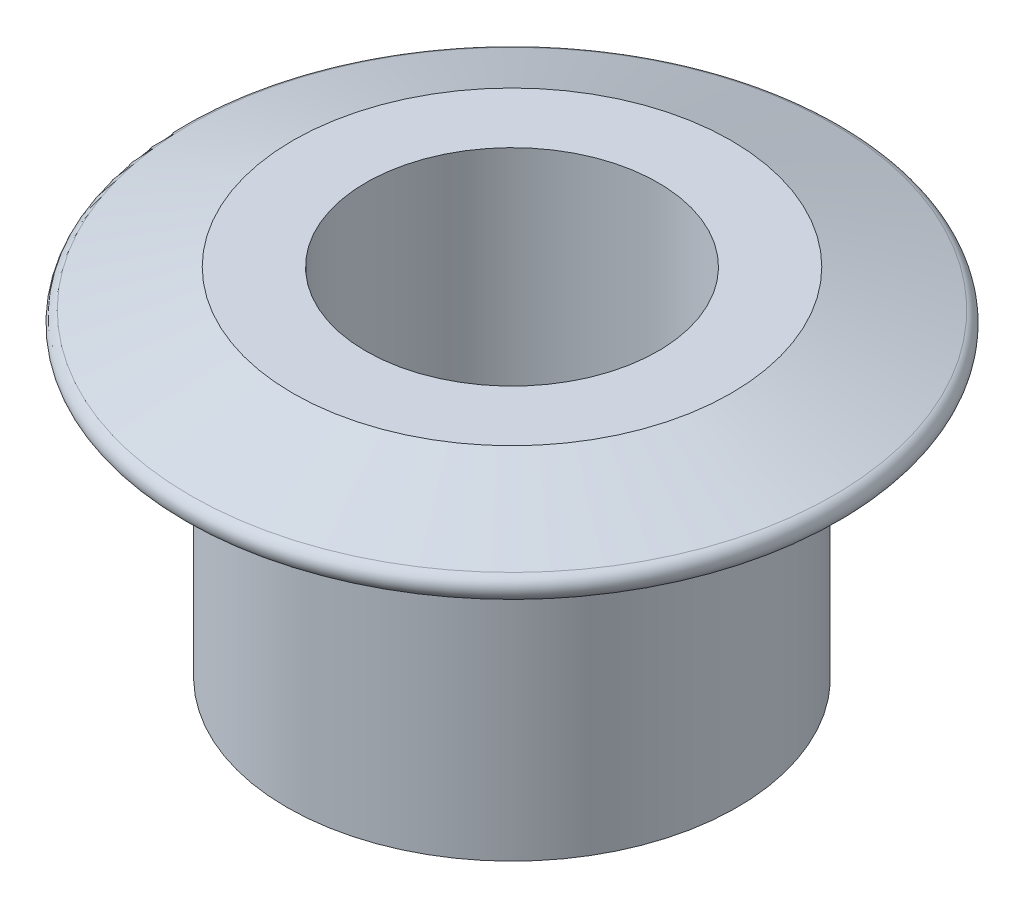
ISO-10303-21;
HEADER;
FILE_DESCRIPTION(('STEP AP214'),'2;1');
FILE_NAME('part.step','',(''),(''),'','','');
FILE_SCHEMA(('AUTOMOTIVE_DESIGN { 1 0 10303 214 1 1 1 1 }'));
ENDSEC;
DATA;
#1=APPLICATION_CONTEXT('core data for automotive mechanical design processes');
#2=APPLICATION_PROTOCOL_DEFINITION('international standard','automotive_design',2000,#1);
#3=PRODUCT_CONTEXT('',#1,'mechanical');
#4=PRODUCT('Part','Part','',(#3));
#5=PRODUCT_RELATED_PRODUCT_CATEGORY('part','',(#4));
#6=PRODUCT_DEFINITION_FORMATION('','',#4);
#7=PRODUCT_DEFINITION_CONTEXT('part definition',#1,'design');
#8=PRODUCT_DEFINITION('design','',#6,#7);
#9=PRODUCT_DEFINITION_SHAPE('','',#8);
#10=(LENGTH_UNIT() NAMED_UNIT(*) SI_UNIT(.MILLI.,.METRE.));
#11=(NAMED_UNIT(*) PLANE_ANGLE_UNIT() SI_UNIT($,.RADIAN.));
#12=(NAMED_UNIT(*) SI_UNIT($,.STERADIAN.) SOLID_ANGLE_UNIT());
#13=UNCERTAINTY_MEASURE_WITH_UNIT(LENGTH_MEASURE(1.E-05),#10,'distance_accuracy_value','');
#14=(GEOMETRIC_REPRESENTATION_CONTEXT(3) GLOBAL_UNCERTAINTY_ASSIGNED_CONTEXT((#13)) GLOBAL_UNIT_ASSIGNED_CONTEXT((#10,
#11,#12)) REPRESENTATION_CONTEXT('',''));
#15=CARTESIAN_POINT('',(0.,0.,0.));
#16=DIRECTION('',(0.,0.,1.));
#17=DIRECTION('',(1.,0.,0.));
#18=AXIS2_PLACEMENT_3D('',#15,#16,#17);
#19=CARTESIAN_POINT('',(0.,5.,0.));
#20=DIRECTION('',(0.,-1.,0.));
#21=DIRECTION('',(0.,0.,-1.));
#22=AXIS2_PLACEMENT_3D('',#19,#20,#21);
#23=PLANE('',#22);
#24=CARTESIAN_POINT('',(0.,5.,0.));
#25=DIRECTION('',(0.,1.,0.));
#26=DIRECTION('',(0.,0.,1.));
#27=AXIS2_PLACEMENT_3D('',#24,#25,#26);
#28=CIRCLE('',#27,12.);
#29=CARTESIAN_POINT('',(0.,5.,12.));
#30=VERTEX_POINT('',#29);
#31=EDGE_CURVE('E57',#30,#30,#28,.T.);
#32=ORIENTED_EDGE('',*,*,#31,.F.);
#33=EDGE_LOOP('',(#32));
#34=FACE_BOUND('',#33,.T.);
#35=CARTESIAN_POINT('',(0.,5.,0.));
#36=DIRECTION('',(0.,1.,0.));
#37=DIRECTION('',(0.,0.,1.));
#38=AXIS2_PLACEMENT_3D('',#35,#36,#37);
#39=CIRCLE('',#38,18.);
#40=CARTESIAN_POINT('',(0.,5.,18.));
#41=VERTEX_POINT('',#40);
#42=EDGE_CURVE('E42',#41,#41,#39,.T.);
#43=ORIENTED_EDGE('',*,*,#42,.T.);
#44=EDGE_LOOP('',(#43));
#45=FACE_BOUND('',#44,.T.);
#46=ADVANCED_FACE('F31',(#34,#45),#23,.F.);
#47=CARTESIAN_POINT('',(0.,0.,0.));
#48=DIRECTION('',(0.,-1.,0.));
#49=DIRECTION('',(0.,0.,-1.));
#50=AXIS2_PLACEMENT_3D('',#47,#48,#49);
#51=CONICAL_SURFACE('',#50,31.76,1.22225874991077);
#52=CARTESIAN_POINT('',(0.,1.93987316983936,0.));
#53=DIRECTION('',(0.,1.,0.));
#54=DIRECTION('',(0.,0.,1.));
#55=AXIS2_PLACEMENT_3D('',#52,#53,#54);
#56=CIRCLE('',#55,26.4214690366021);
#57=CARTESIAN_POINT('',(0.,1.93987316983936,26.4214690366021));
#58=VERTEX_POINT('',#57);
#59=EDGE_CURVE('E38',#58,#58,#56,.T.);
#60=ORIENTED_EDGE('',*,*,#59,.T.);
#61=EDGE_LOOP('',(#60));
#62=FACE_BOUND('',#61,.T.);
#63=ORIENTED_EDGE('',*,*,#42,.F.);
#64=EDGE_LOOP('',(#63));
#65=FACE_BOUND('',#64,.T.);
#66=ADVANCED_FACE('F66',(#62,#65),#51,.T.);
#67=CARTESIAN_POINT('',(31.76,0.,0.));
#68=DIRECTION('',(0.,1.,0.));
#69=DIRECTION('',(0.,0.,1.));
#70=AXIS2_PLACEMENT_3D('',#67,#68,#69);
#71=PLANE('',#70);
#72=CARTESIAN_POINT('',(0.,0.,0.));
#73=DIRECTION('',(0.,1.,0.));
#74=DIRECTION('',(0.,0.,1.));
#75=AXIS2_PLACEMENT_3D('',#72,#73,#74);
#76=CIRCLE('',#75,26.0799453557012);
#77=CARTESIAN_POINT('',(0.,0.,26.0799453557012));
#78=VERTEX_POINT('',#77);
#79=EDGE_CURVE('E10',#78,#78,#76,.F.);
#80=ORIENTED_EDGE('',*,*,#79,.T.);
#81=EDGE_LOOP('',(#80));
#82=FACE_BOUND('',#81,.T.);
#83=CARTESIAN_POINT('',(0.,0.,0.));
#84=DIRECTION('',(0.,1.,0.));
#85=DIRECTION('',(0.,0.,1.));
#86=AXIS2_PLACEMENT_3D('',#83,#84,#85);
#87=CIRCLE('',#86,18.5);
#88=CARTESIAN_POINT('',(0.,0.,18.5));
#89=VERTEX_POINT('',#88);
#90=EDGE_CURVE('E46',#89,#89,#87,.T.);
#91=ORIENTED_EDGE('',*,*,#90,.T.);
#92=EDGE_LOOP('',(#91));
#93=FACE_BOUND('',#92,.T.);
#94=ADVANCED_FACE('F70',(#82,#93),#71,.F.);
#95=CARTESIAN_POINT('',(0.,25.0606870229008,0.));
#96=DIRECTION('',(0.,1.,0.));
#97=DIRECTION('',(0.,0.,1.));
#98=AXIS2_PLACEMENT_3D('',#95,#96,#97);
#99=CYLINDRICAL_SURFACE('',#98,18.5);
#100=ORIENTED_EDGE('',*,*,#90,.F.);
#101=EDGE_LOOP('',(#100));
#102=FACE_BOUND('',#101,.T.);
#103=CARTESIAN_POINT('',(0.,-24.21,0.));
#104=DIRECTION('',(0.,1.,0.));
#105=DIRECTION('',(0.,0.,1.));
#106=AXIS2_PLACEMENT_3D('',#103,#104,#105);
#107=CIRCLE('',#106,18.5);
#108=CARTESIAN_POINT('',(0.,-24.21,18.5));
#109=VERTEX_POINT('',#108);
#110=EDGE_CURVE('E51',#109,#109,#107,.T.);
#111=ORIENTED_EDGE('',*,*,#110,.T.);
#112=EDGE_LOOP('',(#111));
#113=FACE_BOUND('',#112,.T.);
#114=ADVANCED_FACE('F75',(#102,#113),#99,.T.);
#115=CARTESIAN_POINT('',(18.5,-24.21,0.));
#116=DIRECTION('',(0.,1.,0.));
#117=DIRECTION('',(0.,0.,1.));
#118=AXIS2_PLACEMENT_3D('',#115,#116,#117);
#119=PLANE('',#118);
#120=CARTESIAN_POINT('',(0.,-24.21,0.));
#121=DIRECTION('',(0.,1.,0.));
#122=DIRECTION('',(0.,0.,1.));
#123=AXIS2_PLACEMENT_3D('',#120,#121,#122);
#124=CIRCLE('',#123,12.);
#125=CARTESIAN_POINT('',(0.,-24.21,12.));
#126=VERTEX_POINT('',#125);
#127=EDGE_CURVE('E54',#126,#126,#124,.F.);
#128=ORIENTED_EDGE('',*,*,#127,.F.);
#129=EDGE_LOOP('',(#128));
#130=FACE_BOUND('',#129,.T.);
#131=ORIENTED_EDGE('',*,*,#110,.F.);
#132=EDGE_LOOP('',(#131));
#133=FACE_BOUND('',#132,.T.);
#134=ADVANCED_FACE('F80',(#130,#133),#119,.F.);
#135=CARTESIAN_POINT('',(0.,-24.211,0.));
#136=DIRECTION('',(0.,1.,0.));
#137=DIRECTION('',(0.,0.,1.));
#138=AXIS2_PLACEMENT_3D('',#135,#136,#137);
#139=CYLINDRICAL_SURFACE('',#138,12.);
#140=ORIENTED_EDGE('',*,*,#31,.T.);
#141=EDGE_LOOP('',(#140));
#142=FACE_BOUND('',#141,.T.);
#143=ORIENTED_EDGE('',*,*,#127,.T.);
#144=EDGE_LOOP('',(#143));
#145=FACE_BOUND('',#144,.T.);
#146=ADVANCED_FACE('F61',(#142,#145),#139,.F.);
#147=CARTESIAN_POINT('',(0.,0.999999999999999,0.));
#148=DIRECTION('',(0.,1.,0.));
#149=DIRECTION('',(0.,0.,1.));
#150=AXIS2_PLACEMENT_3D('',#147,#148,#149);
#151=TOROIDAL_SURFACE('',#150,26.0799453557012,1.);
#152=ORIENTED_EDGE('',*,*,#79,.F.);
#153=EDGE_LOOP('',(#152));
#154=FACE_BOUND('',#153,.T.);
#155=ORIENTED_EDGE('',*,*,#59,.F.);
#156=EDGE_LOOP('',(#155));
#157=FACE_BOUND('',#156,.T.);
#158=ADVANCED_FACE('F33',(#154,#157),#151,.T.);
#159=CLOSED_SHELL('',(#46,#66,#94,#114,#134,#146,#158));
#160=MANIFOLD_SOLID_BREP('B2',#159);
#161=ADVANCED_BREP_SHAPE_REPRESENTATION('',(#18,#160),#14);
#162=SHAPE_DEFINITION_REPRESENTATION(#9,#161);
ENDSEC;
END-ISO-10303-21;
